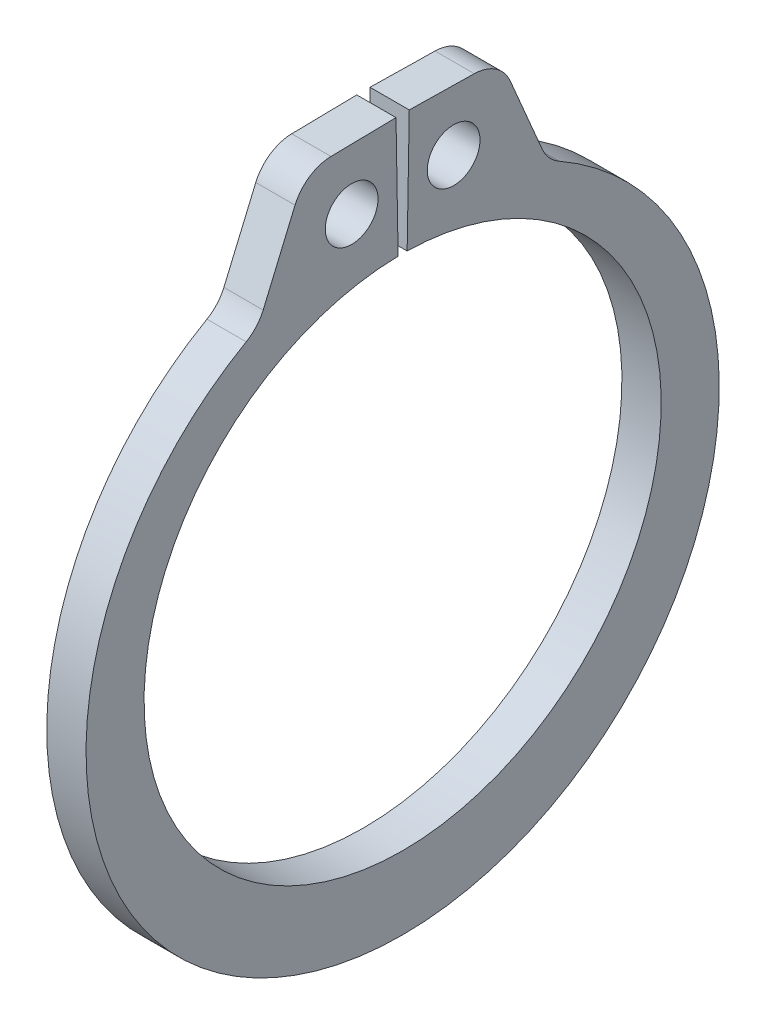
ISO-10303-21;
HEADER;
FILE_DESCRIPTION(('STEP AP214'),'2;1');
FILE_NAME('part.step','',(''),(''),'','','');
FILE_SCHEMA(('AUTOMOTIVE_DESIGN { 1 0 10303 214 1 1 1 1 }'));
ENDSEC;
DATA;
#1=APPLICATION_CONTEXT('core data for automotive mechanical design processes');
#2=APPLICATION_PROTOCOL_DEFINITION('international standard','automotive_design',2000,#1);
#3=PRODUCT_CONTEXT('',#1,'mechanical');
#4=PRODUCT('Part','Part','',(#3));
#5=PRODUCT_RELATED_PRODUCT_CATEGORY('part','',(#4));
#6=PRODUCT_DEFINITION_FORMATION('','',#4);
#7=PRODUCT_DEFINITION_CONTEXT('part definition',#1,'design');
#8=PRODUCT_DEFINITION('design','',#6,#7);
#9=PRODUCT_DEFINITION_SHAPE('','',#8);
#10=(LENGTH_UNIT() NAMED_UNIT(*) SI_UNIT(.MILLI.,.METRE.));
#11=(NAMED_UNIT(*) PLANE_ANGLE_UNIT() SI_UNIT($,.RADIAN.));
#12=(NAMED_UNIT(*) SI_UNIT($,.STERADIAN.) SOLID_ANGLE_UNIT());
#13=UNCERTAINTY_MEASURE_WITH_UNIT(LENGTH_MEASURE(1.E-05),#10,'distance_accuracy_value','');
#14=(GEOMETRIC_REPRESENTATION_CONTEXT(3) GLOBAL_UNCERTAINTY_ASSIGNED_CONTEXT((#13)) GLOBAL_UNIT_ASSIGNED_CONTEXT((#10,
#11,#12)) REPRESENTATION_CONTEXT('',''));
#15=CARTESIAN_POINT('',(0.,0.,0.));
#16=DIRECTION('',(0.,0.,1.));
#17=DIRECTION('',(1.,0.,0.));
#18=AXIS2_PLACEMENT_3D('',#15,#16,#17);
#19=CARTESIAN_POINT('',(0.4445,0.,0.));
#20=DIRECTION('',(1.,0.,0.));
#21=DIRECTION('',(0.,0.,-1.));
#22=AXIS2_PLACEMENT_3D('',#19,#20,#21);
#23=PLANE('',#22);
#24=CARTESIAN_POINT('',(0.4445,7.20724610900658,1.15465964864512));
#25=DIRECTION('',(1.,0.,0.));
#26=DIRECTION('',(0.,0.,-1.));
#27=AXIS2_PLACEMENT_3D('',#24,#25,#26);
#28=CIRCLE('',#27,0.5969);
#29=CARTESIAN_POINT('',(0.4445,7.20724610900658,0.557759648645124));
#30=VERTEX_POINT('',#29);
#31=EDGE_CURVE('E221',#30,#30,#28,.T.);
#32=ORIENTED_EDGE('',*,*,#31,.F.);
#33=EDGE_LOOP('',(#32));
#34=FACE_BOUND('',#33,.T.);
#35=DIRECTION('',(0.,-0.01745240643729,0.999847695156391));
#36=VECTOR('',#35,1.);
#37=CARTESIAN_POINT('',(0.4445,8.59659049818515,0.15005404530712));
#38=LINE('',#37,#36);
#39=CARTESIAN_POINT('',(0.4445,8.59659049818515,0.15005404530712));
#40=VERTEX_POINT('',#39);
#41=CARTESIAN_POINT('',(0.4445,8.5708933863481,1.62224059647238));
#42=VERTEX_POINT('',#41);
#43=EDGE_CURVE('E133',#40,#42,#38,.T.);
#44=ORIENTED_EDGE('',*,*,#43,.T.);
#45=CARTESIAN_POINT('',(0.4445,7.66933071962558,1.60650376158788));
#46=DIRECTION('',(1.,0.,0.));
#47=DIRECTION('',(0.,0.,-1.));
#48=AXIS2_PLACEMENT_3D('',#45,#46,#47);
#49=CIRCLE('',#48,0.9017);
#50=CARTESIAN_POINT('',(0.4445,8.02240621636442,2.43620285379096));
#51=VERTEX_POINT('',#50);
#52=EDGE_CURVE('E174',#42,#51,#49,.T.);
#53=ORIENTED_EDGE('',*,*,#52,.T.);
#54=DIRECTION('',(0.,-0.920149819455566,0.391566481910656));
#55=VECTOR('',#54,1.);
#56=CARTESIAN_POINT('',(0.4445,8.56068391718107,2.20714069332188));
#57=LINE('',#56,#55);
#58=CARTESIAN_POINT('',(0.4445,6.32616456625773,3.15803245301383));
#59=VERTEX_POINT('',#58);
#60=EDGE_CURVE('E213',#51,#59,#57,.T.);
#61=ORIENTED_EDGE('',*,*,#60,.T.);
#62=CARTESIAN_POINT('',(0.4445,6.67924006299657,3.98773154521692));
#63=DIRECTION('',(1.,0.,0.));
#64=DIRECTION('',(0.,0.,-1.));
#65=AXIS2_PLACEMENT_3D('',#62,#63,#64);
#66=CIRCLE('',#65,0.9017);
#67=CARTESIAN_POINT('',(0.4445,5.89530863003733,3.54218199868087));
#68=VERTEX_POINT('',#67);
#69=EDGE_CURVE('E181',#59,#68,#66,.F.);
#70=ORIENTED_EDGE('',*,*,#69,.T.);
#71=CARTESIAN_POINT('',(0.4445,-0.337057291142251,0.));
#72=DIRECTION('',(1.,0.,0.));
#73=DIRECTION('',(0.,0.,-1.));
#74=AXIS2_PLACEMENT_3D('',#71,#72,#73);
#75=CIRCLE('',#74,7.16864270885775);
#76=CARTESIAN_POINT('',(0.4445,5.89530863003733,-3.54218199868087));
#77=VERTEX_POINT('',#76);
#78=EDGE_CURVE('E206',#68,#77,#75,.T.);
#79=ORIENTED_EDGE('',*,*,#78,.T.);
#80=CARTESIAN_POINT('',(0.4445,6.67924006299657,-3.98773154521692));
#81=DIRECTION('',(1.,0.,0.));
#82=DIRECTION('',(0.,0.,-1.));
#83=AXIS2_PLACEMENT_3D('',#80,#81,#82);
#84=CIRCLE('',#83,0.9017);
#85=CARTESIAN_POINT('',(0.4445,6.32616456625773,-3.15803245301383));
#86=VERTEX_POINT('',#85);
#87=EDGE_CURVE('E11',#77,#86,#84,.F.);
#88=ORIENTED_EDGE('',*,*,#87,.T.);
#89=DIRECTION('',(0.,0.920149819455566,0.391566481910656));
#90=VECTOR('',#89,1.);
#91=CARTESIAN_POINT('',(0.4445,8.56068391718107,-2.20714069332188));
#92=LINE('',#91,#90);
#93=CARTESIAN_POINT('',(0.4445,8.02240621636442,-2.43620285379096));
#94=VERTEX_POINT('',#93);
#95=EDGE_CURVE('E205',#86,#94,#92,.T.);
#96=ORIENTED_EDGE('',*,*,#95,.T.);
#97=CARTESIAN_POINT('',(0.4445,7.66933071962558,-1.60650376158788));
#98=DIRECTION('',(1.,0.,0.));
#99=DIRECTION('',(0.,0.,-1.));
#100=AXIS2_PLACEMENT_3D('',#97,#98,#99);
#101=CIRCLE('',#100,0.9017);
#102=CARTESIAN_POINT('',(0.4445,8.5708933863481,-1.62224059647238));
#103=VERTEX_POINT('',#102);
#104=EDGE_CURVE('E49',#94,#103,#101,.T.);
#105=ORIENTED_EDGE('',*,*,#104,.T.);
#106=DIRECTION('',(0.,0.01745240643729,0.999847695156391));
#107=VECTOR('',#106,1.);
#108=CARTESIAN_POINT('',(0.4445,8.59659049818515,-0.15005404530712));
#109=LINE('',#108,#107);
#110=CARTESIAN_POINT('',(0.4445,8.59659049818515,-0.15005404530712));
#111=VERTEX_POINT('',#110);
#112=EDGE_CURVE('E210',#103,#111,#109,.T.);
#113=ORIENTED_EDGE('',*,*,#112,.T.);
#114=DIRECTION('',(0.,-0.999847695156391,0.0174524064372833));
#115=VECTOR('',#114,1.);
#116=CARTESIAN_POINT('',(0.4445,5.85380830083213,-0.102178603968365));
#117=LINE('',#116,#115);
#118=CARTESIAN_POINT('',(0.4445,5.85380830083213,-0.102178603968365));
#119=VERTEX_POINT('',#118);
#120=EDGE_CURVE('E139',#111,#119,#117,.T.);
#121=ORIENTED_EDGE('',*,*,#120,.T.);
#122=CARTESIAN_POINT('',(0.4445,0.,0.));
#123=DIRECTION('',(-1.,0.,0.));
#124=DIRECTION('',(0.,0.,-1.));
#125=AXIS2_PLACEMENT_3D('',#122,#123,#124);
#126=CIRCLE('',#125,5.8547);
#127=CARTESIAN_POINT('',(0.4445,5.85380830083213,0.102178603968365));
#128=VERTEX_POINT('',#127);
#129=EDGE_CURVE('E134',#119,#128,#126,.T.);
#130=ORIENTED_EDGE('',*,*,#129,.T.);
#131=DIRECTION('',(0.,0.999847695156391,0.0174524064372833));
#132=VECTOR('',#131,1.);
#133=CARTESIAN_POINT('',(0.4445,5.85380830083213,0.102178603968365));
#134=LINE('',#133,#132);
#135=EDGE_CURVE('E125',#128,#40,#134,.T.);
#136=ORIENTED_EDGE('',*,*,#135,.T.);
#137=EDGE_LOOP('',(#44,#53,#61,#70,#79,#88,#96,#105,#113,#121,#130,#136));
#138=FACE_BOUND('',#137,.T.);
#139=CARTESIAN_POINT('',(0.4445,7.20724610900658,-1.15465964864512));
#140=DIRECTION('',(1.,0.,0.));
#141=DIRECTION('',(0.,0.,-1.));
#142=AXIS2_PLACEMENT_3D('',#139,#140,#141);
#143=CIRCLE('',#142,0.5969);
#144=CARTESIAN_POINT('',(0.4445,7.20724610900658,-1.75155964864512));
#145=VERTEX_POINT('',#144);
#146=EDGE_CURVE('E247',#145,#145,#143,.T.);
#147=ORIENTED_EDGE('',*,*,#146,.F.);
#148=EDGE_LOOP('',(#147));
#149=FACE_BOUND('',#148,.T.);
#150=ADVANCED_FACE('F34',(#34,#138,#149),#23,.T.);
#151=CARTESIAN_POINT('',(-0.4445,0.,0.));
#152=DIRECTION('',(1.,0.,0.));
#153=DIRECTION('',(0.,0.,-1.));
#154=AXIS2_PLACEMENT_3D('',#151,#152,#153);
#155=PLANE('',#154);
#156=CARTESIAN_POINT('',(-0.4445,7.20724610900658,1.15465964864512));
#157=DIRECTION('',(1.,0.,0.));
#158=DIRECTION('',(0.,0.,-1.));
#159=AXIS2_PLACEMENT_3D('',#156,#157,#158);
#160=CIRCLE('',#159,0.5969);
#161=CARTESIAN_POINT('',(-0.4445,7.20724610900658,0.557759648645124));
#162=VERTEX_POINT('',#161);
#163=EDGE_CURVE('E244',#162,#162,#160,.T.);
#164=ORIENTED_EDGE('',*,*,#163,.T.);
#165=EDGE_LOOP('',(#164));
#166=FACE_BOUND('',#165,.T.);
#167=DIRECTION('',(0.,-0.920149819455566,0.391566481910656));
#168=VECTOR('',#167,1.);
#169=CARTESIAN_POINT('',(-0.4445,8.56068391718107,2.20714069332188));
#170=LINE('',#169,#168);
#171=CARTESIAN_POINT('',(-0.4445,8.02240621636442,2.43620285379096));
#172=VERTEX_POINT('',#171);
#173=CARTESIAN_POINT('',(-0.4445,6.32616456625773,3.15803245301383));
#174=VERTEX_POINT('',#173);
#175=EDGE_CURVE('E200',#172,#174,#170,.T.);
#176=ORIENTED_EDGE('',*,*,#175,.F.);
#177=CARTESIAN_POINT('',(-0.4445,7.66933071962558,1.60650376158788));
#178=DIRECTION('',(1.,0.,0.));
#179=DIRECTION('',(0.,0.,-1.));
#180=AXIS2_PLACEMENT_3D('',#177,#178,#179);
#181=CIRCLE('',#180,0.9017);
#182=CARTESIAN_POINT('',(-0.4445,8.5708933863481,1.62224059647238));
#183=VERTEX_POINT('',#182);
#184=EDGE_CURVE('E170',#172,#183,#181,.F.);
#185=ORIENTED_EDGE('',*,*,#184,.T.);
#186=DIRECTION('',(0.,-0.01745240643729,0.999847695156391));
#187=VECTOR('',#186,1.);
#188=CARTESIAN_POINT('',(-0.4445,8.59659049818515,0.15005404530712));
#189=LINE('',#188,#187);
#190=CARTESIAN_POINT('',(-0.4445,8.59659049818515,0.15005404530712));
#191=VERTEX_POINT('',#190);
#192=EDGE_CURVE('E223',#191,#183,#189,.T.);
#193=ORIENTED_EDGE('',*,*,#192,.F.);
#194=DIRECTION('',(0.,0.999847695156391,0.0174524064372833));
#195=VECTOR('',#194,1.);
#196=CARTESIAN_POINT('',(-0.4445,5.85380830083213,0.102178603968365));
#197=LINE('',#196,#195);
#198=CARTESIAN_POINT('',(-0.4445,5.85380830083213,0.102178603968365));
#199=VERTEX_POINT('',#198);
#200=EDGE_CURVE('E220',#199,#191,#197,.T.);
#201=ORIENTED_EDGE('',*,*,#200,.F.);
#202=CARTESIAN_POINT('',(-0.4445,0.,0.));
#203=DIRECTION('',(-1.,0.,0.));
#204=DIRECTION('',(0.,0.,-1.));
#205=AXIS2_PLACEMENT_3D('',#202,#203,#204);
#206=CIRCLE('',#205,5.8547);
#207=CARTESIAN_POINT('',(-0.4445,5.85380830083213,-0.102178603968365));
#208=VERTEX_POINT('',#207);
#209=EDGE_CURVE('E147',#208,#199,#206,.T.);
#210=ORIENTED_EDGE('',*,*,#209,.F.);
#211=DIRECTION('',(0.,-0.999847695156391,0.0174524064372833));
#212=VECTOR('',#211,1.);
#213=CARTESIAN_POINT('',(-0.4445,5.85380830083213,-0.102178603968365));
#214=LINE('',#213,#212);
#215=CARTESIAN_POINT('',(-0.4445,8.59659049818515,-0.15005404530712));
#216=VERTEX_POINT('',#215);
#217=EDGE_CURVE('E143',#216,#208,#214,.T.);
#218=ORIENTED_EDGE('',*,*,#217,.F.);
#219=DIRECTION('',(0.,0.01745240643729,0.999847695156391));
#220=VECTOR('',#219,1.);
#221=CARTESIAN_POINT('',(-0.4445,8.59659049818515,-0.15005404530712));
#222=LINE('',#221,#220);
#223=CARTESIAN_POINT('',(-0.4445,8.5708933863481,-1.62224059647238));
#224=VERTEX_POINT('',#223);
#225=EDGE_CURVE('E228',#224,#216,#222,.T.);
#226=ORIENTED_EDGE('',*,*,#225,.F.);
#227=CARTESIAN_POINT('',(-0.4445,7.66933071962558,-1.60650376158788));
#228=DIRECTION('',(1.,0.,0.));
#229=DIRECTION('',(0.,0.,-1.));
#230=AXIS2_PLACEMENT_3D('',#227,#228,#229);
#231=CIRCLE('',#230,0.9017);
#232=CARTESIAN_POINT('',(-0.4445,8.02240621636442,-2.43620285379096));
#233=VERTEX_POINT('',#232);
#234=EDGE_CURVE('E168',#224,#233,#231,.F.);
#235=ORIENTED_EDGE('',*,*,#234,.T.);
#236=DIRECTION('',(0.,0.920149819455566,0.391566481910656));
#237=VECTOR('',#236,1.);
#238=CARTESIAN_POINT('',(-0.4445,8.56068391718107,-2.20714069332188));
#239=LINE('',#238,#237);
#240=CARTESIAN_POINT('',(-0.4445,6.32616456625773,-3.15803245301383));
#241=VERTEX_POINT('',#240);
#242=EDGE_CURVE('E191',#241,#233,#239,.T.);
#243=ORIENTED_EDGE('',*,*,#242,.F.);
#244=CARTESIAN_POINT('',(-0.4445,6.67924006299657,-3.98773154521692));
#245=DIRECTION('',(1.,0.,0.));
#246=DIRECTION('',(0.,0.,-1.));
#247=AXIS2_PLACEMENT_3D('',#244,#245,#246);
#248=CIRCLE('',#247,0.9017);
#249=CARTESIAN_POINT('',(-0.4445,5.89530863003733,-3.54218199868087));
#250=VERTEX_POINT('',#249);
#251=EDGE_CURVE('E42',#241,#250,#248,.T.);
#252=ORIENTED_EDGE('',*,*,#251,.T.);
#253=CARTESIAN_POINT('',(-0.4445,-0.337057291142251,0.));
#254=DIRECTION('',(1.,0.,0.));
#255=DIRECTION('',(0.,0.,-1.));
#256=AXIS2_PLACEMENT_3D('',#253,#254,#255);
#257=CIRCLE('',#256,7.16864270885775);
#258=CARTESIAN_POINT('',(-0.4445,5.89530863003733,3.54218199868087));
#259=VERTEX_POINT('',#258);
#260=EDGE_CURVE('E189',#259,#250,#257,.T.);
#261=ORIENTED_EDGE('',*,*,#260,.F.);
#262=CARTESIAN_POINT('',(-0.4445,6.67924006299657,3.98773154521692));
#263=DIRECTION('',(1.,0.,0.));
#264=DIRECTION('',(0.,0.,-1.));
#265=AXIS2_PLACEMENT_3D('',#262,#263,#264);
#266=CIRCLE('',#265,0.9017);
#267=EDGE_CURVE('E179',#259,#174,#266,.T.);
#268=ORIENTED_EDGE('',*,*,#267,.T.);
#269=EDGE_LOOP('',(#176,#185,#193,#201,#210,#218,#226,#235,#243,#252,#261,#268));
#270=FACE_BOUND('',#269,.T.);
#271=CARTESIAN_POINT('',(-0.4445,7.20724610900658,-1.15465964864512));
#272=DIRECTION('',(1.,0.,0.));
#273=DIRECTION('',(0.,0.,-1.));
#274=AXIS2_PLACEMENT_3D('',#271,#272,#273);
#275=CIRCLE('',#274,0.5969);
#276=CARTESIAN_POINT('',(-0.4445,7.20724610900658,-1.75155964864512));
#277=VERTEX_POINT('',#276);
#278=EDGE_CURVE('E250',#277,#277,#275,.T.);
#279=ORIENTED_EDGE('',*,*,#278,.T.);
#280=EDGE_LOOP('',(#279));
#281=FACE_BOUND('',#280,.T.);
#282=ADVANCED_FACE('F187',(#166,#270,#281),#155,.F.);
#283=CARTESIAN_POINT('',(0.4445,0.,0.));
#284=DIRECTION('',(-1.,0.,0.));
#285=DIRECTION('',(0.,0.,1.));
#286=AXIS2_PLACEMENT_3D('',#283,#284,#285);
#287=CYLINDRICAL_SURFACE('',#286,5.8547);
#288=ORIENTED_EDGE('',*,*,#209,.T.);
#289=DIRECTION('',(-1.,0.,0.));
#290=VECTOR('',#289,1.);
#291=CARTESIAN_POINT('',(0.4445,5.85380830083213,0.102178603968365));
#292=LINE('',#291,#290);
#293=EDGE_CURVE('E129',#128,#199,#292,.T.);
#294=ORIENTED_EDGE('',*,*,#293,.F.);
#295=ORIENTED_EDGE('',*,*,#129,.F.);
#296=DIRECTION('',(-1.,0.,0.));
#297=VECTOR('',#296,1.);
#298=CARTESIAN_POINT('',(0.4445,5.85380830083213,-0.102178603968365));
#299=LINE('',#298,#297);
#300=EDGE_CURVE('E218',#119,#208,#299,.T.);
#301=ORIENTED_EDGE('',*,*,#300,.T.);
#302=EDGE_LOOP('',(#288,#294,#295,#301));
#303=FACE_BOUND('',#302,.T.);
#304=ADVANCED_FACE('F145',(#303),#287,.F.);
#305=CARTESIAN_POINT('',(0.4445,5.85380830083213,0.102178603968365));
#306=DIRECTION('',(0.,-0.0174524064372833,0.999847695156391));
#307=DIRECTION('',(0.,-0.999847695156391,-0.0174524064372833));
#308=AXIS2_PLACEMENT_3D('',#305,#306,#307);
#309=PLANE('',#308);
#310=ORIENTED_EDGE('',*,*,#200,.T.);
#311=DIRECTION('',(-1.,0.,0.));
#312=VECTOR('',#311,1.);
#313=CARTESIAN_POINT('',(0.4445,8.59659049818515,0.15005404530712));
#314=LINE('',#313,#312);
#315=EDGE_CURVE('E132',#40,#191,#314,.T.);
#316=ORIENTED_EDGE('',*,*,#315,.F.);
#317=ORIENTED_EDGE('',*,*,#135,.F.);
#318=ORIENTED_EDGE('',*,*,#293,.T.);
#319=EDGE_LOOP('',(#310,#316,#317,#318));
#320=FACE_BOUND('',#319,.T.);
#321=ADVANCED_FACE('F127',(#320),#309,.F.);
#322=CARTESIAN_POINT('',(0.4445,8.59659049818515,0.15005404530712));
#323=DIRECTION('',(0.,-0.999847695156391,-0.01745240643729));
#324=DIRECTION('',(0.,0.01745240643729,-0.999847695156391));
#325=AXIS2_PLACEMENT_3D('',#322,#323,#324);
#326=PLANE('',#325);
#327=ORIENTED_EDGE('',*,*,#192,.T.);
#328=DIRECTION('',(-1.,0.,0.));
#329=VECTOR('',#328,1.);
#330=CARTESIAN_POINT('',(0.4445,8.5708933863481,1.62224059647238));
#331=LINE('',#330,#329);
#332=EDGE_CURVE('E57',#183,#42,#331,.F.);
#333=ORIENTED_EDGE('',*,*,#332,.T.);
#334=ORIENTED_EDGE('',*,*,#43,.F.);
#335=ORIENTED_EDGE('',*,*,#315,.T.);
#336=EDGE_LOOP('',(#327,#333,#334,#335));
#337=FACE_BOUND('',#336,.T.);
#338=ADVANCED_FACE('F239',(#337),#326,.F.);
#339=CARTESIAN_POINT('',(0.4445,8.56068391718107,2.20714069332188));
#340=DIRECTION('',(0.,-0.391566481910657,-0.920149819455567));
#341=DIRECTION('',(0.,0.920149819455567,-0.391566481910657));
#342=AXIS2_PLACEMENT_3D('',#339,#340,#341);
#343=PLANE('',#342);
#344=ORIENTED_EDGE('',*,*,#175,.T.);
#345=DIRECTION('',(1.,0.,0.));
#346=VECTOR('',#345,1.);
#347=CARTESIAN_POINT('',(0.4445,6.32616456625773,3.15803245301383));
#348=LINE('',#347,#346);
#349=EDGE_CURVE('E161',#174,#59,#348,.T.);
#350=ORIENTED_EDGE('',*,*,#349,.T.);
#351=ORIENTED_EDGE('',*,*,#60,.F.);
#352=DIRECTION('',(-1.,0.,0.));
#353=VECTOR('',#352,1.);
#354=CARTESIAN_POINT('',(0.4445,8.02240621636442,2.43620285379096));
#355=LINE('',#354,#353);
#356=EDGE_CURVE('E158',#51,#172,#355,.T.);
#357=ORIENTED_EDGE('',*,*,#356,.T.);
#358=EDGE_LOOP('',(#344,#350,#351,#357));
#359=FACE_BOUND('',#358,.T.);
#360=ADVANCED_FACE('F280',(#359),#343,.F.);
#361=CARTESIAN_POINT('',(0.4445,-0.337057291142251,0.));
#362=DIRECTION('',(-1.,0.,0.));
#363=DIRECTION('',(0.,0.,1.));
#364=AXIS2_PLACEMENT_3D('',#361,#362,#363);
#365=CYLINDRICAL_SURFACE('',#364,7.16864270885775);
#366=ORIENTED_EDGE('',*,*,#78,.F.);
#367=DIRECTION('',(-1.,0.,0.));
#368=VECTOR('',#367,1.);
#369=CARTESIAN_POINT('',(0.4445,5.89530863003733,3.54218199868087));
#370=LINE('',#369,#368);
#371=EDGE_CURVE('E150',#68,#259,#370,.T.);
#372=ORIENTED_EDGE('',*,*,#371,.T.);
#373=ORIENTED_EDGE('',*,*,#260,.T.);
#374=DIRECTION('',(-1.,0.,0.));
#375=VECTOR('',#374,1.);
#376=CARTESIAN_POINT('',(0.4445,5.89530863003733,-3.54218199868087));
#377=LINE('',#376,#375);
#378=EDGE_CURVE('E148',#250,#77,#377,.F.);
#379=ORIENTED_EDGE('',*,*,#378,.T.);
#380=EDGE_LOOP('',(#366,#372,#373,#379));
#381=FACE_BOUND('',#380,.T.);
#382=ADVANCED_FACE('F197',(#381),#365,.T.);
#383=CARTESIAN_POINT('',(0.4445,8.56068391718107,-2.20714069332188));
#384=DIRECTION('',(0.,-0.391566481910657,0.920149819455567));
#385=DIRECTION('',(0.,-0.920149819455567,-0.391566481910657));
#386=AXIS2_PLACEMENT_3D('',#383,#384,#385);
#387=PLANE('',#386);
#388=ORIENTED_EDGE('',*,*,#95,.F.);
#389=DIRECTION('',(1.,0.,0.));
#390=VECTOR('',#389,1.);
#391=CARTESIAN_POINT('',(-0.4445,6.32616456625773,-3.15803245301383));
#392=LINE('',#391,#390);
#393=EDGE_CURVE('E165',#86,#241,#392,.F.);
#394=ORIENTED_EDGE('',*,*,#393,.T.);
#395=ORIENTED_EDGE('',*,*,#242,.T.);
#396=DIRECTION('',(-1.,0.,0.));
#397=VECTOR('',#396,1.);
#398=CARTESIAN_POINT('',(0.4445,8.02240621636442,-2.43620285379096));
#399=LINE('',#398,#397);
#400=EDGE_CURVE('E163',#233,#94,#399,.F.);
#401=ORIENTED_EDGE('',*,*,#400,.T.);
#402=EDGE_LOOP('',(#388,#394,#395,#401));
#403=FACE_BOUND('',#402,.T.);
#404=ADVANCED_FACE('F208',(#403),#387,.F.);
#405=CARTESIAN_POINT('',(0.4445,8.59659049818515,-0.15005404530712));
#406=DIRECTION('',(0.,-0.999847695156391,0.01745240643729));
#407=DIRECTION('',(0.,-0.01745240643729,-0.999847695156391));
#408=AXIS2_PLACEMENT_3D('',#405,#406,#407);
#409=PLANE('',#408);
#410=ORIENTED_EDGE('',*,*,#112,.F.);
#411=DIRECTION('',(-1.,0.,0.));
#412=VECTOR('',#411,1.);
#413=CARTESIAN_POINT('',(0.4445,8.5708933863481,-1.62224059647238));
#414=LINE('',#413,#412);
#415=EDGE_CURVE('E176',#103,#224,#414,.T.);
#416=ORIENTED_EDGE('',*,*,#415,.T.);
#417=ORIENTED_EDGE('',*,*,#225,.T.);
#418=DIRECTION('',(-1.,0.,0.));
#419=VECTOR('',#418,1.);
#420=CARTESIAN_POINT('',(0.4445,8.59659049818515,-0.15005404530712));
#421=LINE('',#420,#419);
#422=EDGE_CURVE('E152',#111,#216,#421,.T.);
#423=ORIENTED_EDGE('',*,*,#422,.F.);
#424=EDGE_LOOP('',(#410,#416,#417,#423));
#425=FACE_BOUND('',#424,.T.);
#426=ADVANCED_FACE('F273',(#425),#409,.F.);
#427=CARTESIAN_POINT('',(0.4445,5.85380830083213,-0.102178603968365));
#428=DIRECTION('',(0.,-0.0174524064372833,-0.999847695156391));
#429=DIRECTION('',(0.,0.999847695156391,-0.0174524064372833));
#430=AXIS2_PLACEMENT_3D('',#427,#428,#429);
#431=PLANE('',#430);
#432=ORIENTED_EDGE('',*,*,#217,.T.);
#433=ORIENTED_EDGE('',*,*,#300,.F.);
#434=ORIENTED_EDGE('',*,*,#120,.F.);
#435=ORIENTED_EDGE('',*,*,#422,.T.);
#436=EDGE_LOOP('',(#432,#433,#434,#435));
#437=FACE_BOUND('',#436,.T.);
#438=ADVANCED_FACE('F235',(#437),#431,.F.);
#439=CARTESIAN_POINT('',(0.4445,7.20724610900658,1.15465964864512));
#440=DIRECTION('',(-1.,0.,0.));
#441=DIRECTION('',(0.,0.,1.));
#442=AXIS2_PLACEMENT_3D('',#439,#440,#441);
#443=CYLINDRICAL_SURFACE('',#442,0.5969);
#444=ORIENTED_EDGE('',*,*,#31,.T.);
#445=EDGE_LOOP('',(#444));
#446=FACE_BOUND('',#445,.T.);
#447=ORIENTED_EDGE('',*,*,#163,.F.);
#448=EDGE_LOOP('',(#447));
#449=FACE_BOUND('',#448,.T.);
#450=ADVANCED_FACE('F268',(#446,#449),#443,.F.);
#451=CARTESIAN_POINT('',(0.4445,7.20724610900658,-1.15465964864512));
#452=DIRECTION('',(-1.,0.,0.));
#453=DIRECTION('',(0.,0.,1.));
#454=AXIS2_PLACEMENT_3D('',#451,#452,#453);
#455=CYLINDRICAL_SURFACE('',#454,0.5969);
#456=ORIENTED_EDGE('',*,*,#146,.T.);
#457=EDGE_LOOP('',(#456));
#458=FACE_BOUND('',#457,.T.);
#459=ORIENTED_EDGE('',*,*,#278,.F.);
#460=EDGE_LOOP('',(#459));
#461=FACE_BOUND('',#460,.T.);
#462=ADVANCED_FACE('F256',(#458,#461),#455,.F.);
#463=CARTESIAN_POINT('',(0.4445,6.67924006299657,3.98773154521692));
#464=DIRECTION('',(-1.,0.,0.));
#465=DIRECTION('',(0.,0.,1.));
#466=AXIS2_PLACEMENT_3D('',#463,#464,#465);
#467=CYLINDRICAL_SURFACE('',#466,0.9017);
#468=ORIENTED_EDGE('',*,*,#69,.F.);
#469=ORIENTED_EDGE('',*,*,#349,.F.);
#470=ORIENTED_EDGE('',*,*,#267,.F.);
#471=ORIENTED_EDGE('',*,*,#371,.F.);
#472=EDGE_LOOP('',(#468,#469,#470,#471));
#473=FACE_BOUND('',#472,.T.);
#474=ADVANCED_FACE('F290',(#473),#467,.F.);
#475=CARTESIAN_POINT('',(0.4445,6.67924006299657,-3.98773154521692));
#476=DIRECTION('',(-1.,0.,0.));
#477=DIRECTION('',(0.,0.,1.));
#478=AXIS2_PLACEMENT_3D('',#475,#476,#477);
#479=CYLINDRICAL_SURFACE('',#478,0.9017);
#480=ORIENTED_EDGE('',*,*,#87,.F.);
#481=ORIENTED_EDGE('',*,*,#378,.F.);
#482=ORIENTED_EDGE('',*,*,#251,.F.);
#483=ORIENTED_EDGE('',*,*,#393,.F.);
#484=EDGE_LOOP('',(#480,#481,#482,#483));
#485=FACE_BOUND('',#484,.T.);
#486=ADVANCED_FACE('F203',(#485),#479,.F.);
#487=CARTESIAN_POINT('',(0.4445,7.66933071962558,1.60650376158788));
#488=DIRECTION('',(-1.,0.,0.));
#489=DIRECTION('',(0.,0.,1.));
#490=AXIS2_PLACEMENT_3D('',#487,#488,#489);
#491=CYLINDRICAL_SURFACE('',#490,0.9017);
#492=ORIENTED_EDGE('',*,*,#52,.F.);
#493=ORIENTED_EDGE('',*,*,#332,.F.);
#494=ORIENTED_EDGE('',*,*,#184,.F.);
#495=ORIENTED_EDGE('',*,*,#356,.F.);
#496=EDGE_LOOP('',(#492,#493,#494,#495));
#497=FACE_BOUND('',#496,.T.);
#498=ADVANCED_FACE('F295',(#497),#491,.T.);
#499=CARTESIAN_POINT('',(0.4445,7.66933071962558,-1.60650376158788));
#500=DIRECTION('',(-1.,0.,0.));
#501=DIRECTION('',(0.,0.,1.));
#502=AXIS2_PLACEMENT_3D('',#499,#500,#501);
#503=CYLINDRICAL_SURFACE('',#502,0.9017);
#504=ORIENTED_EDGE('',*,*,#104,.F.);
#505=ORIENTED_EDGE('',*,*,#400,.F.);
#506=ORIENTED_EDGE('',*,*,#234,.F.);
#507=ORIENTED_EDGE('',*,*,#415,.F.);
#508=EDGE_LOOP('',(#504,#505,#506,#507));
#509=FACE_BOUND('',#508,.T.);
#510=ADVANCED_FACE('F36',(#509),#503,.T.);
#511=CLOSED_SHELL('',(#150,#282,#304,#321,#338,#360,#382,#404,#426,#438,#450,#462,#474,#486,
#498,#510));
#512=MANIFOLD_SOLID_BREP('B2',#511);
#513=ADVANCED_BREP_SHAPE_REPRESENTATION('',(#18,#512),#14);
#514=SHAPE_DEFINITION_REPRESENTATION(#9,#513);
ENDSEC;
END-ISO-10303-21;
